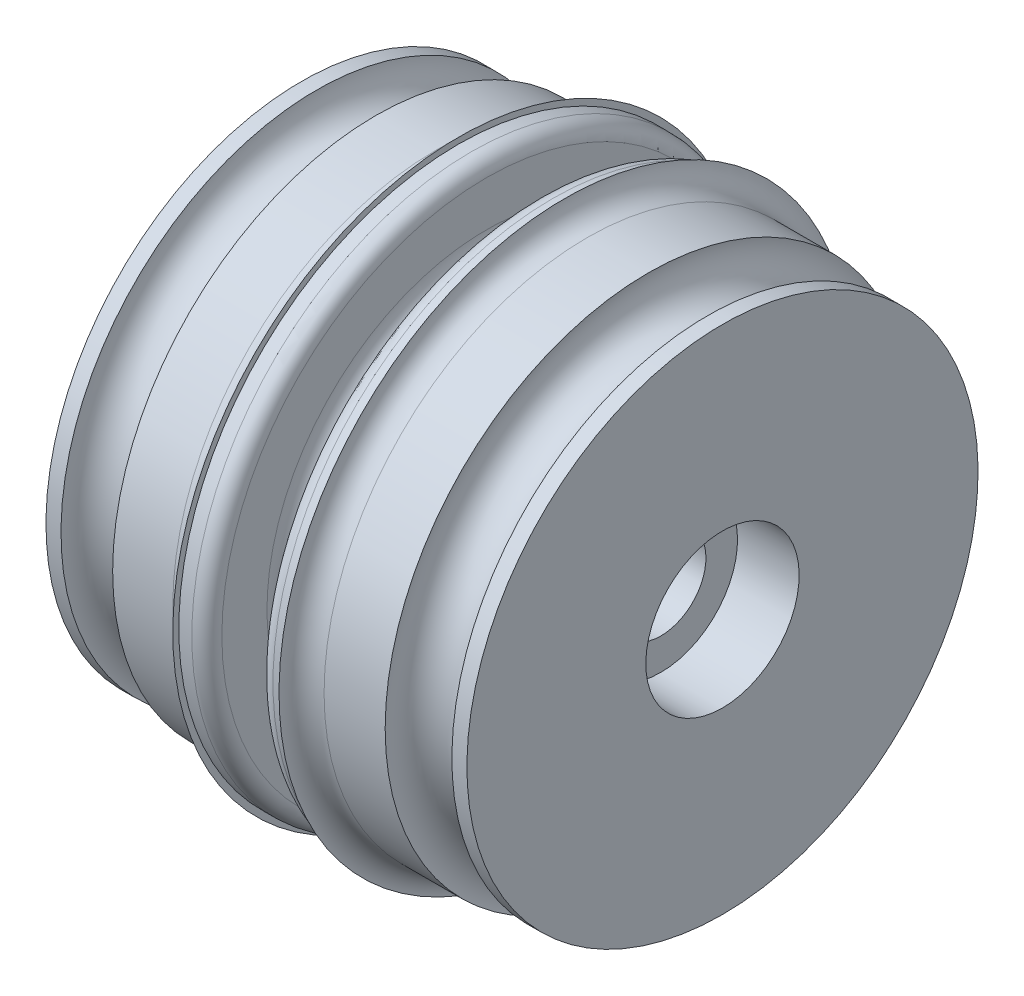
ISO-10303-21;
HEADER;
FILE_DESCRIPTION(('STEP AP214'),'2;1');
FILE_NAME('part.step','',(''),(''),'','','');
FILE_SCHEMA(('AUTOMOTIVE_DESIGN { 1 0 10303 214 1 1 1 1 }'));
ENDSEC;
DATA;
#1=APPLICATION_CONTEXT('core data for automotive mechanical design processes');
#2=APPLICATION_PROTOCOL_DEFINITION('international standard','automotive_design',2000,#1);
#3=PRODUCT_CONTEXT('',#1,'mechanical');
#4=PRODUCT('Part','Part','',(#3));
#5=PRODUCT_RELATED_PRODUCT_CATEGORY('part','',(#4));
#6=PRODUCT_DEFINITION_FORMATION('','',#4);
#7=PRODUCT_DEFINITION_CONTEXT('part definition',#1,'design');
#8=PRODUCT_DEFINITION('design','',#6,#7);
#9=PRODUCT_DEFINITION_SHAPE('','',#8);
#10=(LENGTH_UNIT() NAMED_UNIT(*) SI_UNIT(.MILLI.,.METRE.));
#11=(NAMED_UNIT(*) PLANE_ANGLE_UNIT() SI_UNIT($,.RADIAN.));
#12=(NAMED_UNIT(*) SI_UNIT($,.STERADIAN.) SOLID_ANGLE_UNIT());
#13=UNCERTAINTY_MEASURE_WITH_UNIT(LENGTH_MEASURE(1.E-05),#10,'distance_accuracy_value','');
#14=(GEOMETRIC_REPRESENTATION_CONTEXT(3) GLOBAL_UNCERTAINTY_ASSIGNED_CONTEXT((#13)) GLOBAL_UNIT_ASSIGNED_CONTEXT((#10,
#11,#12)) REPRESENTATION_CONTEXT('',''));
#15=CARTESIAN_POINT('',(0.,0.,0.));
#16=DIRECTION('',(0.,0.,1.));
#17=DIRECTION('',(1.,0.,0.));
#18=AXIS2_PLACEMENT_3D('',#15,#16,#17);
#19=CARTESIAN_POINT('',(4.40039127225962,5.1,0.));
#20=DIRECTION('',(1.,0.,0.));
#21=DIRECTION('',(0.,1.,0.));
#22=AXIS2_PLACEMENT_3D('',#19,#20,#21);
#23=PLANE('',#22);
#24=CARTESIAN_POINT('',(4.40039127225962,0.,0.));
#25=DIRECTION('',(-1.,0.,0.));
#26=DIRECTION('',(0.,-1.,0.));
#27=AXIS2_PLACEMENT_3D('',#24,#25,#26);
#28=CIRCLE('',#27,3.);
#29=CARTESIAN_POINT('',(4.40039127225962,-3.,0.));
#30=VERTEX_POINT('',#29);
#31=EDGE_CURVE('E10',#30,#30,#28,.T.);
#32=ORIENTED_EDGE('',*,*,#31,.F.);
#33=EDGE_LOOP('',(#32));
#34=FACE_BOUND('',#33,.T.);
#35=CARTESIAN_POINT('',(4.40039127225962,0.,0.));
#36=DIRECTION('',(-1.,0.,0.));
#37=DIRECTION('',(0.,-1.,0.));
#38=AXIS2_PLACEMENT_3D('',#35,#36,#37);
#39=CIRCLE('',#38,5.1);
#40=CARTESIAN_POINT('',(4.40039127225962,-5.1,0.));
#41=VERTEX_POINT('',#40);
#42=EDGE_CURVE('E114',#41,#41,#39,.T.);
#43=ORIENTED_EDGE('',*,*,#42,.T.);
#44=EDGE_LOOP('',(#43));
#45=FACE_BOUND('',#44,.T.);
#46=ADVANCED_FACE('F32',(#34,#45),#23,.F.);
#47=CARTESIAN_POINT('',(0.,0.,0.));
#48=DIRECTION('',(-1.,0.,0.));
#49=DIRECTION('',(0.,-1.,0.));
#50=AXIS2_PLACEMENT_3D('',#47,#48,#49);
#51=CYLINDRICAL_SURFACE('',#50,3.);
#52=CARTESIAN_POINT('',(24.2003912722596,0.,0.));
#53=DIRECTION('',(-1.,0.,0.));
#54=DIRECTION('',(0.,-1.,0.));
#55=AXIS2_PLACEMENT_3D('',#52,#53,#54);
#56=CIRCLE('',#55,3.);
#57=CARTESIAN_POINT('',(24.2003912722596,-3.,0.));
#58=VERTEX_POINT('',#57);
#59=EDGE_CURVE('E38',#58,#58,#56,.T.);
#60=ORIENTED_EDGE('',*,*,#59,.F.);
#61=EDGE_LOOP('',(#60));
#62=FACE_BOUND('',#61,.T.);
#63=ORIENTED_EDGE('',*,*,#31,.T.);
#64=EDGE_LOOP('',(#63));
#65=FACE_BOUND('',#64,.T.);
#66=ADVANCED_FACE('F259',(#62,#65),#51,.F.);
#67=CARTESIAN_POINT('',(24.2003912722596,3.,0.));
#68=DIRECTION('',(-1.,0.,0.));
#69=DIRECTION('',(0.,-1.,0.));
#70=AXIS2_PLACEMENT_3D('',#67,#68,#69);
#71=PLANE('',#70);
#72=CARTESIAN_POINT('',(24.2003912722596,0.,0.));
#73=DIRECTION('',(-1.,0.,0.));
#74=DIRECTION('',(0.,-1.,0.));
#75=AXIS2_PLACEMENT_3D('',#72,#73,#74);
#76=CIRCLE('',#75,5.1);
#77=CARTESIAN_POINT('',(24.2003912722596,-5.1,0.));
#78=VERTEX_POINT('',#77);
#79=EDGE_CURVE('E42',#78,#78,#76,.T.);
#80=ORIENTED_EDGE('',*,*,#79,.F.);
#81=EDGE_LOOP('',(#80));
#82=FACE_BOUND('',#81,.T.);
#83=ORIENTED_EDGE('',*,*,#59,.T.);
#84=EDGE_LOOP('',(#83));
#85=FACE_BOUND('',#84,.T.);
#86=ADVANCED_FACE('F254',(#82,#85),#71,.F.);
#87=CARTESIAN_POINT('',(0.,0.,0.));
#88=DIRECTION('',(-1.,0.,0.));
#89=DIRECTION('',(0.,-1.,0.));
#90=AXIS2_PLACEMENT_3D('',#87,#88,#89);
#91=CYLINDRICAL_SURFACE('',#90,5.1);
#92=CARTESIAN_POINT('',(28.3003912722596,0.,0.));
#93=DIRECTION('',(-1.,0.,0.));
#94=DIRECTION('',(0.,-1.,0.));
#95=AXIS2_PLACEMENT_3D('',#92,#93,#94);
#96=CIRCLE('',#95,5.1);
#97=CARTESIAN_POINT('',(28.3003912722596,-5.1,0.));
#98=VERTEX_POINT('',#97);
#99=EDGE_CURVE('E46',#98,#98,#96,.T.);
#100=ORIENTED_EDGE('',*,*,#99,.F.);
#101=EDGE_LOOP('',(#100));
#102=FACE_BOUND('',#101,.T.);
#103=ORIENTED_EDGE('',*,*,#79,.T.);
#104=EDGE_LOOP('',(#103));
#105=FACE_BOUND('',#104,.T.);
#106=ADVANCED_FACE('F248',(#102,#105),#91,.F.);
#107=CARTESIAN_POINT('',(28.3003912722596,17.,0.));
#108=DIRECTION('',(-1.,0.,0.));
#109=DIRECTION('',(0.,-1.,0.));
#110=AXIS2_PLACEMENT_3D('',#107,#108,#109);
#111=PLANE('',#110);
#112=CARTESIAN_POINT('',(28.3003912722596,0.,0.));
#113=DIRECTION('',(-1.,0.,0.));
#114=DIRECTION('',(0.,-1.,0.));
#115=AXIS2_PLACEMENT_3D('',#112,#113,#114);
#116=CIRCLE('',#115,17.);
#117=CARTESIAN_POINT('',(28.3003912722596,-17.,0.));
#118=VERTEX_POINT('',#117);
#119=EDGE_CURVE('E51',#118,#118,#116,.T.);
#120=ORIENTED_EDGE('',*,*,#119,.F.);
#121=EDGE_LOOP('',(#120));
#122=FACE_BOUND('',#121,.T.);
#123=ORIENTED_EDGE('',*,*,#99,.T.);
#124=EDGE_LOOP('',(#123));
#125=FACE_BOUND('',#124,.T.);
#126=ADVANCED_FACE('F242',(#122,#125),#111,.F.);
#127=CARTESIAN_POINT('',(0.,0.,0.));
#128=DIRECTION('',(-1.,0.,0.));
#129=DIRECTION('',(0.,-1.,0.));
#130=AXIS2_PLACEMENT_3D('',#127,#128,#129);
#131=CYLINDRICAL_SURFACE('',#130,17.);
#132=CARTESIAN_POINT('',(27.3003912722596,0.,0.));
#133=DIRECTION('',(-1.,0.,0.));
#134=DIRECTION('',(0.,-1.,0.));
#135=AXIS2_PLACEMENT_3D('',#132,#133,#134);
#136=CIRCLE('',#135,17.);
#137=CARTESIAN_POINT('',(27.3003912722596,-17.,0.));
#138=VERTEX_POINT('',#137);
#139=EDGE_CURVE('E54',#138,#138,#136,.T.);
#140=ORIENTED_EDGE('',*,*,#139,.F.);
#141=EDGE_LOOP('',(#140));
#142=FACE_BOUND('',#141,.T.);
#143=ORIENTED_EDGE('',*,*,#119,.T.);
#144=EDGE_LOOP('',(#143));
#145=FACE_BOUND('',#144,.T.);
#146=ADVANCED_FACE('F236',(#142,#145),#131,.T.);
#147=CARTESIAN_POINT('',(25.3003912722596,0.,0.));
#148=DIRECTION('',(-1.,0.,0.));
#149=DIRECTION('',(0.,-1.,0.));
#150=AXIS2_PLACEMENT_3D('',#147,#148,#149);
#151=TOROIDAL_SURFACE('',#150,17.,2.);
#152=CARTESIAN_POINT('',(23.3638995991559,0.,0.));
#153=DIRECTION('',(-1.,0.,0.));
#154=DIRECTION('',(0.,-1.,0.));
#155=AXIS2_PLACEMENT_3D('',#152,#153,#154);
#156=CIRCLE('',#155,17.5);
#157=CARTESIAN_POINT('',(23.3638995991559,-17.5,0.));
#158=VERTEX_POINT('',#157);
#159=EDGE_CURVE('E57',#158,#158,#156,.T.);
#160=ORIENTED_EDGE('',*,*,#159,.F.);
#161=EDGE_LOOP('',(#160));
#162=FACE_BOUND('',#161,.T.);
#163=ORIENTED_EDGE('',*,*,#139,.T.);
#164=EDGE_LOOP('',(#163));
#165=FACE_BOUND('',#164,.T.);
#166=ADVANCED_FACE('F230',(#162,#165),#151,.F.);
#167=CARTESIAN_POINT('',(0.,0.,0.));
#168=DIRECTION('',(-1.,0.,0.));
#169=DIRECTION('',(0.,-1.,0.));
#170=AXIS2_PLACEMENT_3D('',#167,#168,#169);
#171=CYLINDRICAL_SURFACE('',#170,17.5);
#172=CARTESIAN_POINT('',(19.3003912722596,0.,0.));
#173=DIRECTION('',(-1.,0.,0.));
#174=DIRECTION('',(0.,-1.,0.));
#175=AXIS2_PLACEMENT_3D('',#172,#173,#174);
#176=CIRCLE('',#175,17.5);
#177=CARTESIAN_POINT('',(19.3003912722596,-17.5,0.));
#178=VERTEX_POINT('',#177);
#179=EDGE_CURVE('E60',#178,#178,#176,.T.);
#180=ORIENTED_EDGE('',*,*,#179,.F.);
#181=EDGE_LOOP('',(#180));
#182=FACE_BOUND('',#181,.T.);
#183=ORIENTED_EDGE('',*,*,#159,.T.);
#184=EDGE_LOOP('',(#183));
#185=FACE_BOUND('',#184,.T.);
#186=ADVANCED_FACE('F224',(#182,#185),#171,.T.);
#187=CARTESIAN_POINT('',(19.3003912722596,0.,0.));
#188=DIRECTION('',(-1.,0.,0.));
#189=DIRECTION('',(0.,-1.,0.));
#190=AXIS2_PLACEMENT_3D('',#187,#188,#189);
#191=TOROIDAL_SURFACE('',#190,19.,1.5);
#192=CARTESIAN_POINT('',(17.8003912722596,0.,0.));
#193=DIRECTION('',(-1.,0.,0.));
#194=DIRECTION('',(0.,-1.,0.));
#195=AXIS2_PLACEMENT_3D('',#192,#193,#194);
#196=CIRCLE('',#195,19.);
#197=CARTESIAN_POINT('',(17.8003912722596,-19.,0.));
#198=VERTEX_POINT('',#197);
#199=EDGE_CURVE('E63',#198,#198,#196,.T.);
#200=ORIENTED_EDGE('',*,*,#199,.F.);
#201=EDGE_LOOP('',(#200));
#202=FACE_BOUND('',#201,.T.);
#203=ORIENTED_EDGE('',*,*,#179,.T.);
#204=EDGE_LOOP('',(#203));
#205=FACE_BOUND('',#204,.T.);
#206=ADVANCED_FACE('F218',(#202,#205),#191,.F.);
#207=CARTESIAN_POINT('',(17.8003912722596,19.,0.));
#208=DIRECTION('',(1.,0.,0.));
#209=DIRECTION('',(0.,1.,0.));
#210=AXIS2_PLACEMENT_3D('',#207,#208,#209);
#211=PLANE('',#210);
#212=CARTESIAN_POINT('',(17.8003912722596,0.,0.));
#213=DIRECTION('',(-1.,0.,0.));
#214=DIRECTION('',(0.,-1.,0.));
#215=AXIS2_PLACEMENT_3D('',#212,#213,#214);
#216=CIRCLE('',#215,18.6);
#217=CARTESIAN_POINT('',(17.8003912722596,-18.6,0.));
#218=VERTEX_POINT('',#217);
#219=EDGE_CURVE('E66',#218,#218,#216,.T.);
#220=ORIENTED_EDGE('',*,*,#219,.F.);
#221=EDGE_LOOP('',(#220));
#222=FACE_BOUND('',#221,.T.);
#223=ORIENTED_EDGE('',*,*,#199,.T.);
#224=EDGE_LOOP('',(#223));
#225=FACE_BOUND('',#224,.T.);
#226=ADVANCED_FACE('F212',(#222,#225),#211,.F.);
#227=CARTESIAN_POINT('',(0.,0.,0.));
#228=DIRECTION('',(-1.,0.,0.));
#229=DIRECTION('',(0.,-1.,0.));
#230=AXIS2_PLACEMENT_3D('',#227,#228,#229);
#231=CYLINDRICAL_SURFACE('',#230,18.6);
#232=CARTESIAN_POINT('',(17.0003912722596,0.,0.));
#233=DIRECTION('',(-1.,0.,0.));
#234=DIRECTION('',(0.,-1.,0.));
#235=AXIS2_PLACEMENT_3D('',#232,#233,#234);
#236=CIRCLE('',#235,18.6);
#237=CARTESIAN_POINT('',(17.0003912722596,-18.6,0.));
#238=VERTEX_POINT('',#237);
#239=EDGE_CURVE('E69',#238,#238,#236,.T.);
#240=ORIENTED_EDGE('',*,*,#239,.F.);
#241=EDGE_LOOP('',(#240));
#242=FACE_BOUND('',#241,.T.);
#243=ORIENTED_EDGE('',*,*,#219,.T.);
#244=EDGE_LOOP('',(#243));
#245=FACE_BOUND('',#244,.T.);
#246=ADVANCED_FACE('F206',(#242,#245),#231,.T.);
#247=CARTESIAN_POINT('',(17.0003912722596,0.,0.));
#248=DIRECTION('',(-1.,0.,0.));
#249=DIRECTION('',(0.,-1.,0.));
#250=AXIS2_PLACEMENT_3D('',#247,#248,#249);
#251=TOROIDAL_SURFACE('',#250,17.6,0.999999999999999);
#252=CARTESIAN_POINT('',(16.0003912722596,0.,0.));
#253=DIRECTION('',(-1.,0.,0.));
#254=DIRECTION('',(0.,-1.,0.));
#255=AXIS2_PLACEMENT_3D('',#252,#253,#254);
#256=CIRCLE('',#255,17.6);
#257=CARTESIAN_POINT('',(16.0003912722596,-17.6,0.));
#258=VERTEX_POINT('',#257);
#259=EDGE_CURVE('E72',#258,#258,#256,.T.);
#260=ORIENTED_EDGE('',*,*,#259,.F.);
#261=EDGE_LOOP('',(#260));
#262=FACE_BOUND('',#261,.T.);
#263=ORIENTED_EDGE('',*,*,#239,.T.);
#264=EDGE_LOOP('',(#263));
#265=FACE_BOUND('',#264,.T.);
#266=ADVANCED_FACE('F200',(#262,#265),#251,.T.);
#267=CARTESIAN_POINT('',(16.0003912722596,14.6,0.));
#268=DIRECTION('',(1.,0.,0.));
#269=DIRECTION('',(0.,1.,0.));
#270=AXIS2_PLACEMENT_3D('',#267,#268,#269);
#271=PLANE('',#270);
#272=CARTESIAN_POINT('',(16.0003912722596,0.,0.));
#273=DIRECTION('',(-1.,0.,0.));
#274=DIRECTION('',(0.,-1.,0.));
#275=AXIS2_PLACEMENT_3D('',#272,#273,#274);
#276=CIRCLE('',#275,14.6);
#277=CARTESIAN_POINT('',(16.0003912722596,-14.6,0.));
#278=VERTEX_POINT('',#277);
#279=EDGE_CURVE('E75',#278,#278,#276,.T.);
#280=ORIENTED_EDGE('',*,*,#279,.F.);
#281=EDGE_LOOP('',(#280));
#282=FACE_BOUND('',#281,.T.);
#283=ORIENTED_EDGE('',*,*,#259,.T.);
#284=EDGE_LOOP('',(#283));
#285=FACE_BOUND('',#284,.T.);
#286=ADVANCED_FACE('F194',(#282,#285),#271,.F.);
#287=CARTESIAN_POINT('',(14.5003912722596,0.,0.));
#288=DIRECTION('',(-1.,0.,0.));
#289=DIRECTION('',(0.,-1.,0.));
#290=AXIS2_PLACEMENT_3D('',#287,#288,#289);
#291=TOROIDAL_SURFACE('',#290,14.6,1.5);
#292=CARTESIAN_POINT('',(14.5003912722596,0.,0.));
#293=DIRECTION('',(-1.,0.,0.));
#294=DIRECTION('',(0.,-1.,0.));
#295=AXIS2_PLACEMENT_3D('',#292,#293,#294);
#296=CIRCLE('',#295,13.1);
#297=CARTESIAN_POINT('',(14.5003912722596,-13.1,0.));
#298=VERTEX_POINT('',#297);
#299=EDGE_CURVE('E78',#298,#298,#296,.T.);
#300=ORIENTED_EDGE('',*,*,#299,.F.);
#301=EDGE_LOOP('',(#300));
#302=FACE_BOUND('',#301,.T.);
#303=ORIENTED_EDGE('',*,*,#279,.T.);
#304=EDGE_LOOP('',(#303));
#305=FACE_BOUND('',#304,.T.);
#306=ADVANCED_FACE('F188',(#302,#305),#291,.F.);
#307=CARTESIAN_POINT('',(0.,0.,0.));
#308=DIRECTION('',(-1.,0.,0.));
#309=DIRECTION('',(0.,-1.,0.));
#310=AXIS2_PLACEMENT_3D('',#307,#308,#309);
#311=CYLINDRICAL_SURFACE('',#310,13.1);
#312=CARTESIAN_POINT('',(14.1003912722596,0.,0.));
#313=DIRECTION('',(-1.,0.,0.));
#314=DIRECTION('',(0.,-1.,0.));
#315=AXIS2_PLACEMENT_3D('',#312,#313,#314);
#316=CIRCLE('',#315,13.1);
#317=CARTESIAN_POINT('',(14.1003912722596,-13.1,0.));
#318=VERTEX_POINT('',#317);
#319=EDGE_CURVE('E81',#318,#318,#316,.T.);
#320=ORIENTED_EDGE('',*,*,#319,.F.);
#321=EDGE_LOOP('',(#320));
#322=FACE_BOUND('',#321,.T.);
#323=ORIENTED_EDGE('',*,*,#299,.T.);
#324=EDGE_LOOP('',(#323));
#325=FACE_BOUND('',#324,.T.);
#326=ADVANCED_FACE('F182',(#322,#325),#311,.T.);
#327=CARTESIAN_POINT('',(14.1003912722596,0.,0.));
#328=DIRECTION('',(-1.,0.,0.));
#329=DIRECTION('',(0.,-1.,0.));
#330=AXIS2_PLACEMENT_3D('',#327,#328,#329);
#331=TOROIDAL_SURFACE('',#330,14.6,1.5);
#332=CARTESIAN_POINT('',(12.6003912722596,0.,0.));
#333=DIRECTION('',(-1.,0.,0.));
#334=DIRECTION('',(0.,-1.,0.));
#335=AXIS2_PLACEMENT_3D('',#332,#333,#334);
#336=CIRCLE('',#335,14.6);
#337=CARTESIAN_POINT('',(12.6003912722596,-14.6,0.));
#338=VERTEX_POINT('',#337);
#339=EDGE_CURVE('E84',#338,#338,#336,.T.);
#340=ORIENTED_EDGE('',*,*,#339,.F.);
#341=EDGE_LOOP('',(#340));
#342=FACE_BOUND('',#341,.T.);
#343=ORIENTED_EDGE('',*,*,#319,.T.);
#344=EDGE_LOOP('',(#343));
#345=FACE_BOUND('',#344,.T.);
#346=ADVANCED_FACE('F176',(#342,#345),#331,.F.);
#347=CARTESIAN_POINT('',(12.6003912722596,14.6,0.));
#348=DIRECTION('',(-1.,0.,0.));
#349=DIRECTION('',(0.,-1.,0.));
#350=AXIS2_PLACEMENT_3D('',#347,#348,#349);
#351=PLANE('',#350);
#352=CARTESIAN_POINT('',(12.6003912722596,0.,0.));
#353=DIRECTION('',(-1.,0.,0.));
#354=DIRECTION('',(0.,-1.,0.));
#355=AXIS2_PLACEMENT_3D('',#352,#353,#354);
#356=CIRCLE('',#355,17.6);
#357=CARTESIAN_POINT('',(12.6003912722596,-17.6,0.));
#358=VERTEX_POINT('',#357);
#359=EDGE_CURVE('E87',#358,#358,#356,.T.);
#360=ORIENTED_EDGE('',*,*,#359,.F.);
#361=EDGE_LOOP('',(#360));
#362=FACE_BOUND('',#361,.T.);
#363=ORIENTED_EDGE('',*,*,#339,.T.);
#364=EDGE_LOOP('',(#363));
#365=FACE_BOUND('',#364,.T.);
#366=ADVANCED_FACE('F170',(#362,#365),#351,.F.);
#367=CARTESIAN_POINT('',(11.6003912722596,0.,0.));
#368=DIRECTION('',(-1.,0.,0.));
#369=DIRECTION('',(0.,-1.,0.));
#370=AXIS2_PLACEMENT_3D('',#367,#368,#369);
#371=TOROIDAL_SURFACE('',#370,17.6,0.999999999999999);
#372=CARTESIAN_POINT('',(11.6003912722596,0.,0.));
#373=DIRECTION('',(-1.,0.,0.));
#374=DIRECTION('',(0.,-1.,0.));
#375=AXIS2_PLACEMENT_3D('',#372,#373,#374);
#376=CIRCLE('',#375,18.6);
#377=CARTESIAN_POINT('',(11.6003912722596,-18.6,0.));
#378=VERTEX_POINT('',#377);
#379=EDGE_CURVE('E90',#378,#378,#376,.T.);
#380=ORIENTED_EDGE('',*,*,#379,.F.);
#381=EDGE_LOOP('',(#380));
#382=FACE_BOUND('',#381,.T.);
#383=ORIENTED_EDGE('',*,*,#359,.T.);
#384=EDGE_LOOP('',(#383));
#385=FACE_BOUND('',#384,.T.);
#386=ADVANCED_FACE('F164',(#382,#385),#371,.T.);
#387=CARTESIAN_POINT('',(0.,0.,0.));
#388=DIRECTION('',(-1.,0.,0.));
#389=DIRECTION('',(0.,-1.,0.));
#390=AXIS2_PLACEMENT_3D('',#387,#388,#389);
#391=CYLINDRICAL_SURFACE('',#390,18.6);
#392=CARTESIAN_POINT('',(10.7368829453633,0.,0.));
#393=DIRECTION('',(-1.,0.,0.));
#394=DIRECTION('',(0.,-1.,0.));
#395=AXIS2_PLACEMENT_3D('',#392,#393,#394);
#396=CIRCLE('',#395,18.6);
#397=CARTESIAN_POINT('',(10.7368829453633,-18.6,0.));
#398=VERTEX_POINT('',#397);
#399=EDGE_CURVE('E93',#398,#398,#396,.T.);
#400=ORIENTED_EDGE('',*,*,#399,.F.);
#401=EDGE_LOOP('',(#400));
#402=FACE_BOUND('',#401,.T.);
#403=ORIENTED_EDGE('',*,*,#379,.T.);
#404=EDGE_LOOP('',(#403));
#405=FACE_BOUND('',#404,.T.);
#406=ADVANCED_FACE('F158',(#402,#405),#391,.T.);
#407=CARTESIAN_POINT('',(10.7368829453633,18.6,0.));
#408=DIRECTION('',(-1.,0.,0.));
#409=DIRECTION('',(0.,-1.,0.));
#410=AXIS2_PLACEMENT_3D('',#407,#408,#409);
#411=PLANE('',#410);
#412=CARTESIAN_POINT('',(10.7368829453633,0.,0.));
#413=DIRECTION('',(-1.,0.,0.));
#414=DIRECTION('',(0.,-1.,0.));
#415=AXIS2_PLACEMENT_3D('',#412,#413,#414);
#416=CIRCLE('',#415,19.);
#417=CARTESIAN_POINT('',(10.7368829453633,-19.,0.));
#418=VERTEX_POINT('',#417);
#419=EDGE_CURVE('E96',#418,#418,#416,.T.);
#420=ORIENTED_EDGE('',*,*,#419,.F.);
#421=EDGE_LOOP('',(#420));
#422=FACE_BOUND('',#421,.T.);
#423=ORIENTED_EDGE('',*,*,#399,.T.);
#424=EDGE_LOOP('',(#423));
#425=FACE_BOUND('',#424,.T.);
#426=ADVANCED_FACE('F152',(#422,#425),#411,.F.);
#427=CARTESIAN_POINT('',(9.23688294536334,0.,0.));
#428=DIRECTION('',(-1.,0.,0.));
#429=DIRECTION('',(0.,-1.,0.));
#430=AXIS2_PLACEMENT_3D('',#427,#428,#429);
#431=TOROIDAL_SURFACE('',#430,19.,1.5);
#432=CARTESIAN_POINT('',(9.23688294536334,0.,0.));
#433=DIRECTION('',(-1.,0.,0.));
#434=DIRECTION('',(0.,-1.,0.));
#435=AXIS2_PLACEMENT_3D('',#432,#433,#434);
#436=CIRCLE('',#435,17.5);
#437=CARTESIAN_POINT('',(9.23688294536334,-17.5,0.));
#438=VERTEX_POINT('',#437);
#439=EDGE_CURVE('E99',#438,#438,#436,.T.);
#440=ORIENTED_EDGE('',*,*,#439,.F.);
#441=EDGE_LOOP('',(#440));
#442=FACE_BOUND('',#441,.T.);
#443=ORIENTED_EDGE('',*,*,#419,.T.);
#444=EDGE_LOOP('',(#443));
#445=FACE_BOUND('',#444,.T.);
#446=ADVANCED_FACE('F146',(#442,#445),#431,.F.);
#447=CARTESIAN_POINT('',(0.,0.,0.));
#448=DIRECTION('',(-1.,0.,0.));
#449=DIRECTION('',(0.,-1.,0.));
#450=AXIS2_PLACEMENT_3D('',#447,#448,#449);
#451=CYLINDRICAL_SURFACE('',#450,17.5);
#452=CARTESIAN_POINT('',(5.23688294536334,0.,0.));
#453=DIRECTION('',(-1.,0.,0.));
#454=DIRECTION('',(0.,-1.,0.));
#455=AXIS2_PLACEMENT_3D('',#452,#453,#454);
#456=CIRCLE('',#455,17.5);
#457=CARTESIAN_POINT('',(5.23688294536334,-17.5,0.));
#458=VERTEX_POINT('',#457);
#459=EDGE_CURVE('E102',#458,#458,#456,.T.);
#460=ORIENTED_EDGE('',*,*,#459,.F.);
#461=EDGE_LOOP('',(#460));
#462=FACE_BOUND('',#461,.T.);
#463=ORIENTED_EDGE('',*,*,#439,.T.);
#464=EDGE_LOOP('',(#463));
#465=FACE_BOUND('',#464,.T.);
#466=ADVANCED_FACE('F140',(#462,#465),#451,.T.);
#467=CARTESIAN_POINT('',(3.30039127225963,0.,0.));
#468=DIRECTION('',(-1.,0.,0.));
#469=DIRECTION('',(0.,-1.,0.));
#470=AXIS2_PLACEMENT_3D('',#467,#468,#469);
#471=TOROIDAL_SURFACE('',#470,17.,2.);
#472=CARTESIAN_POINT('',(1.30039127225963,0.,0.));
#473=DIRECTION('',(-1.,0.,0.));
#474=DIRECTION('',(0.,-1.,0.));
#475=AXIS2_PLACEMENT_3D('',#472,#473,#474);
#476=CIRCLE('',#475,17.);
#477=CARTESIAN_POINT('',(1.30039127225963,-17.,0.));
#478=VERTEX_POINT('',#477);
#479=EDGE_CURVE('E105',#478,#478,#476,.T.);
#480=ORIENTED_EDGE('',*,*,#479,.F.);
#481=EDGE_LOOP('',(#480));
#482=FACE_BOUND('',#481,.T.);
#483=ORIENTED_EDGE('',*,*,#459,.T.);
#484=EDGE_LOOP('',(#483));
#485=FACE_BOUND('',#484,.T.);
#486=ADVANCED_FACE('F134',(#482,#485),#471,.F.);
#487=CARTESIAN_POINT('',(0.,0.,0.));
#488=DIRECTION('',(-1.,0.,0.));
#489=DIRECTION('',(0.,-1.,0.));
#490=AXIS2_PLACEMENT_3D('',#487,#488,#489);
#491=CYLINDRICAL_SURFACE('',#490,17.);
#492=CARTESIAN_POINT('',(0.300391272259623,0.,0.));
#493=DIRECTION('',(-1.,0.,0.));
#494=DIRECTION('',(0.,-1.,0.));
#495=AXIS2_PLACEMENT_3D('',#492,#493,#494);
#496=CIRCLE('',#495,17.);
#497=CARTESIAN_POINT('',(0.300391272259623,-17.,0.));
#498=VERTEX_POINT('',#497);
#499=EDGE_CURVE('E108',#498,#498,#496,.T.);
#500=ORIENTED_EDGE('',*,*,#499,.F.);
#501=EDGE_LOOP('',(#500));
#502=FACE_BOUND('',#501,.T.);
#503=ORIENTED_EDGE('',*,*,#479,.T.);
#504=EDGE_LOOP('',(#503));
#505=FACE_BOUND('',#504,.T.);
#506=ADVANCED_FACE('F128',(#502,#505),#491,.T.);
#507=CARTESIAN_POINT('',(0.300391272259621,17.,0.));
#508=DIRECTION('',(1.,0.,0.));
#509=DIRECTION('',(0.,1.,0.));
#510=AXIS2_PLACEMENT_3D('',#507,#508,#509);
#511=PLANE('',#510);
#512=CARTESIAN_POINT('',(0.300391272259618,0.,0.));
#513=DIRECTION('',(-1.,0.,0.));
#514=DIRECTION('',(0.,-1.,0.));
#515=AXIS2_PLACEMENT_3D('',#512,#513,#514);
#516=CIRCLE('',#515,5.1);
#517=CARTESIAN_POINT('',(0.300391272259618,-5.1,0.));
#518=VERTEX_POINT('',#517);
#519=EDGE_CURVE('E111',#518,#518,#516,.T.);
#520=ORIENTED_EDGE('',*,*,#519,.F.);
#521=EDGE_LOOP('',(#520));
#522=FACE_BOUND('',#521,.T.);
#523=ORIENTED_EDGE('',*,*,#499,.T.);
#524=EDGE_LOOP('',(#523));
#525=FACE_BOUND('',#524,.T.);
#526=ADVANCED_FACE('F122',(#522,#525),#511,.F.);
#527=CARTESIAN_POINT('',(0.,0.,0.));
#528=DIRECTION('',(-1.,0.,0.));
#529=DIRECTION('',(0.,-1.,0.));
#530=AXIS2_PLACEMENT_3D('',#527,#528,#529);
#531=CYLINDRICAL_SURFACE('',#530,5.1);
#532=ORIENTED_EDGE('',*,*,#42,.F.);
#533=EDGE_LOOP('',(#532));
#534=FACE_BOUND('',#533,.T.);
#535=ORIENTED_EDGE('',*,*,#519,.T.);
#536=EDGE_LOOP('',(#535));
#537=FACE_BOUND('',#536,.T.);
#538=ADVANCED_FACE('F119',(#534,#537),#531,.F.);
#539=CLOSED_SHELL('',(#46,#66,#86,#106,#126,#146,#166,#186,#206,#226,#246,#266,#286,#306,#326,
#346,#366,#386,#406,#426,#446,#466,#486,#506,#526,#538));
#540=MANIFOLD_SOLID_BREP('B2',#539);
#541=ADVANCED_BREP_SHAPE_REPRESENTATION('',(#18,#540),#14);
#542=SHAPE_DEFINITION_REPRESENTATION(#9,#541);
ENDSEC;
END-ISO-10303-21;
